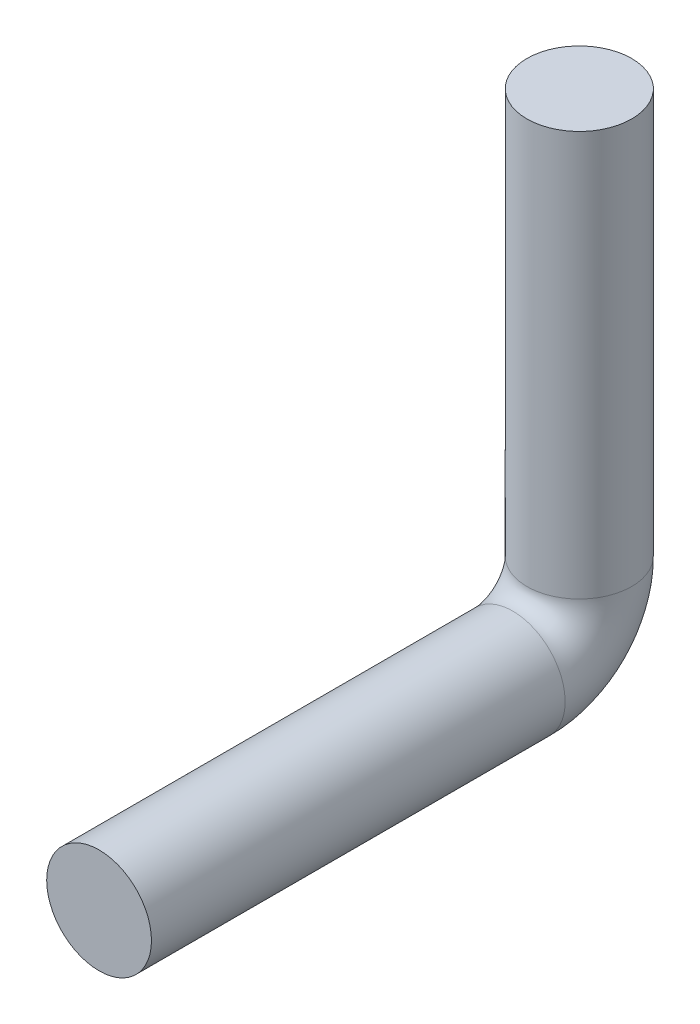
ISO-10303-21;
HEADER;
FILE_DESCRIPTION(('STEP AP214'),'2;1');
FILE_NAME('part.step','',(''),(''),'','','');
FILE_SCHEMA(('AUTOMOTIVE_DESIGN { 1 0 10303 214 1 1 1 1 }'));
ENDSEC;
DATA;
#1=APPLICATION_CONTEXT('core data for automotive mechanical design processes');
#2=APPLICATION_PROTOCOL_DEFINITION('international standard','automotive_design',2000,#1);
#3=PRODUCT_CONTEXT('',#1,'mechanical');
#4=PRODUCT('Part','Part','',(#3));
#5=PRODUCT_RELATED_PRODUCT_CATEGORY('part','',(#4));
#6=PRODUCT_DEFINITION_FORMATION('','',#4);
#7=PRODUCT_DEFINITION_CONTEXT('part definition',#1,'design');
#8=PRODUCT_DEFINITION('design','',#6,#7);
#9=PRODUCT_DEFINITION_SHAPE('','',#8);
#10=(LENGTH_UNIT() NAMED_UNIT(*) SI_UNIT(.MILLI.,.METRE.));
#11=(NAMED_UNIT(*) PLANE_ANGLE_UNIT() SI_UNIT($,.RADIAN.));
#12=(NAMED_UNIT(*) SI_UNIT($,.STERADIAN.) SOLID_ANGLE_UNIT());
#13=UNCERTAINTY_MEASURE_WITH_UNIT(LENGTH_MEASURE(1.E-05),#10,'distance_accuracy_value','');
#14=(GEOMETRIC_REPRESENTATION_CONTEXT(3) GLOBAL_UNCERTAINTY_ASSIGNED_CONTEXT((#13)) GLOBAL_UNIT_ASSIGNED_CONTEXT((#10,
#11,#12)) REPRESENTATION_CONTEXT('',''));
#15=CARTESIAN_POINT('',(0.,0.,0.));
#16=DIRECTION('',(0.,0.,1.));
#17=DIRECTION('',(1.,0.,0.));
#18=AXIS2_PLACEMENT_3D('',#15,#16,#17);
#19=CARTESIAN_POINT('',(0.,0.,0.));
#20=DIRECTION('',(0.,1.,0.));
#21=DIRECTION('',(0.,0.,1.));
#22=AXIS2_PLACEMENT_3D('',#19,#20,#21);
#23=PLANE('',#22);
#24=CARTESIAN_POINT('',(0.,0.,0.));
#25=DIRECTION('',(0.,1.,0.));
#26=DIRECTION('',(0.,0.,1.));
#27=AXIS2_PLACEMENT_3D('',#24,#25,#26);
#28=CIRCLE('',#27,30.);
#29=CARTESIAN_POINT('',(0.,0.,30.));
#30=VERTEX_POINT('',#29);
#31=EDGE_CURVE('E49',#30,#30,#28,.T.);
#32=ORIENTED_EDGE('',*,*,#31,.T.);
#33=EDGE_LOOP('',(#32));
#34=FACE_BOUND('',#33,.T.);
#35=ADVANCED_FACE('F35',(#34),#23,.T.);
#36=CARTESIAN_POINT('',(0.,-270.,275.));
#37=DIRECTION('',(0.,0.,-1.));
#38=DIRECTION('',(0.,1.,0.));
#39=AXIS2_PLACEMENT_3D('',#36,#37,#38);
#40=PLANE('',#39);
#41=CARTESIAN_POINT('',(0.,-270.,275.));
#42=DIRECTION('',(0.,0.,-1.));
#43=DIRECTION('',(0.,1.,0.));
#44=AXIS2_PLACEMENT_3D('',#41,#42,#43);
#45=CIRCLE('',#44,30.);
#46=CARTESIAN_POINT('',(0.,-240.,275.));
#47=VERTEX_POINT('',#46);
#48=EDGE_CURVE('E10',#47,#47,#45,.T.);
#49=ORIENTED_EDGE('',*,*,#48,.F.);
#50=EDGE_LOOP('',(#49));
#51=FACE_BOUND('',#50,.T.);
#52=ADVANCED_FACE('F59',(#51),#40,.F.);
#53=CARTESIAN_POINT('',(0.,0.,0.));
#54=DIRECTION('',(0.,-1.,0.));
#55=DIRECTION('',(0.,0.,-1.));
#56=AXIS2_PLACEMENT_3D('',#53,#54,#55);
#57=CYLINDRICAL_SURFACE('',#56,30.);
#58=CARTESIAN_POINT('',(0.,-231.9,0.));
#59=DIRECTION('',(0.,1.,0.));
#60=DIRECTION('',(0.,0.,1.));
#61=AXIS2_PLACEMENT_3D('',#58,#59,#60);
#62=CIRCLE('',#61,30.);
#63=CARTESIAN_POINT('',(0.,-231.9,-30.));
#64=VERTEX_POINT('',#63);
#65=EDGE_CURVE('E45',#64,#64,#62,.T.);
#66=ORIENTED_EDGE('',*,*,#65,.T.);
#67=EDGE_LOOP('',(#66));
#68=FACE_BOUND('',#67,.T.);
#69=ORIENTED_EDGE('',*,*,#31,.F.);
#70=EDGE_LOOP('',(#69));
#71=FACE_BOUND('',#70,.T.);
#72=ADVANCED_FACE('F56',(#68,#71),#57,.T.);
#73=CARTESIAN_POINT('',(0.,-231.9,38.1));
#74=DIRECTION('',(-1.,0.,0.));
#75=DIRECTION('',(0.,0.,1.));
#76=AXIS2_PLACEMENT_3D('',#73,#74,#75);
#77=TOROIDAL_SURFACE('',#76,38.1,30.);
#78=CARTESIAN_POINT('',(0.,-270.,38.1));
#79=DIRECTION('',(0.,0.,-1.));
#80=DIRECTION('',(0.,1.,0.));
#81=AXIS2_PLACEMENT_3D('',#78,#79,#80);
#82=CIRCLE('',#81,30.);
#83=CARTESIAN_POINT('',(0.,-300.,38.1));
#84=VERTEX_POINT('',#83);
#85=EDGE_CURVE('E41',#84,#84,#82,.T.);
#86=CARTESIAN_POINT('',(0.,-231.9,38.1));
#87=DIRECTION('',(-1.,0.,0.));
#88=DIRECTION('',(0.,0.,1.));
#89=AXIS2_PLACEMENT_3D('',#86,#87,#88);
#90=CIRCLE('',#89,68.1);
#91=EDGE_CURVE('',#64,#84,#90,.T.);
#92=ORIENTED_EDGE('',*,*,#65,.F.);
#93=ORIENTED_EDGE('',*,*,#85,.T.);
#94=ORIENTED_EDGE('',*,*,#91,.T.);
#95=ORIENTED_EDGE('',*,*,#91,.F.);
#96=EDGE_LOOP('',(#92,#94,#93,#95));
#97=FACE_BOUND('',#96,.T.);
#98=ADVANCED_FACE('F58',(#97),#77,.T.);
#99=CARTESIAN_POINT('',(0.,-270.,38.1));
#100=DIRECTION('',(0.,0.,1.));
#101=DIRECTION('',(0.,-1.,0.));
#102=AXIS2_PLACEMENT_3D('',#99,#100,#101);
#103=CYLINDRICAL_SURFACE('',#102,30.);
#104=ORIENTED_EDGE('',*,*,#48,.T.);
#105=EDGE_LOOP('',(#104));
#106=FACE_BOUND('',#105,.T.);
#107=ORIENTED_EDGE('',*,*,#85,.F.);
#108=EDGE_LOOP('',(#107));
#109=FACE_BOUND('',#108,.T.);
#110=ADVANCED_FACE('F66',(#106,#109),#103,.T.);
#111=CLOSED_SHELL('',(#35,#52,#72,#98,#110));
#112=MANIFOLD_SOLID_BREP('B2',#111);
#113=ADVANCED_BREP_SHAPE_REPRESENTATION('',(#18,#112),#14);
#114=SHAPE_DEFINITION_REPRESENTATION(#9,#113);
ENDSEC;
END-ISO-10303-21;
